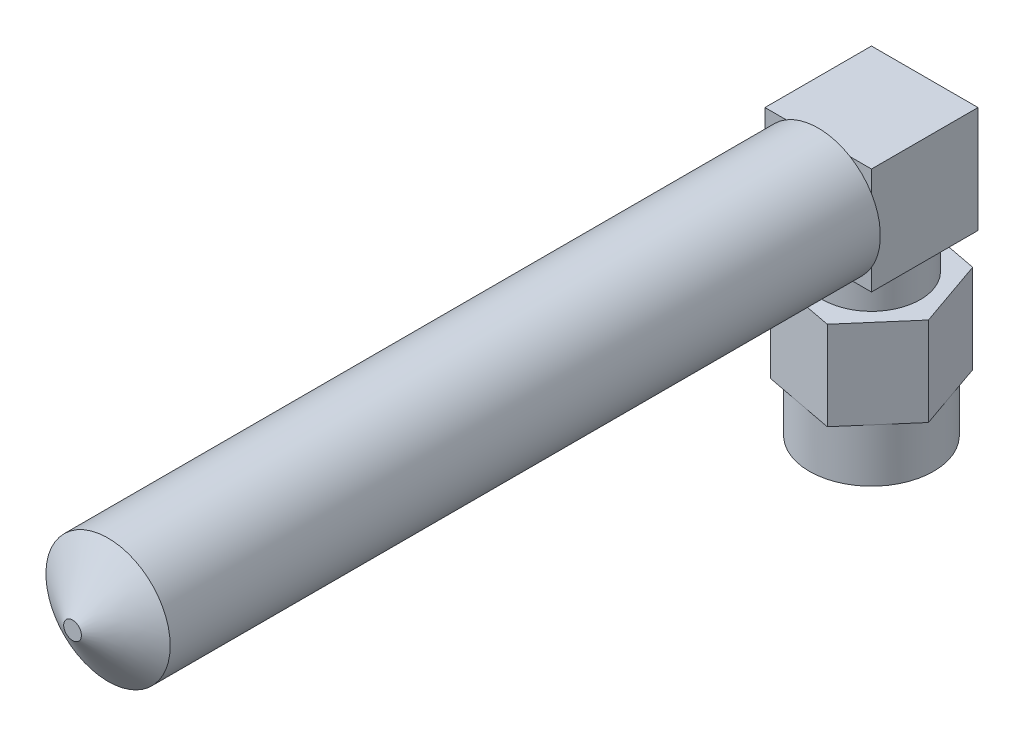
ISO-10303-21;
HEADER;
FILE_DESCRIPTION(('STEP AP214'),'2;1');
FILE_NAME('part.step','',(''),(''),'','','');
FILE_SCHEMA(('AUTOMOTIVE_DESIGN { 1 0 10303 214 1 1 1 1 }'));
ENDSEC;
DATA;
#1=APPLICATION_CONTEXT('core data for automotive mechanical design processes');
#2=APPLICATION_PROTOCOL_DEFINITION('international standard','automotive_design',2000,#1);
#3=PRODUCT_CONTEXT('',#1,'mechanical');
#4=PRODUCT('Part','Part','',(#3));
#5=PRODUCT_RELATED_PRODUCT_CATEGORY('part','',(#4));
#6=PRODUCT_DEFINITION_FORMATION('','',#4);
#7=PRODUCT_DEFINITION_CONTEXT('part definition',#1,'design');
#8=PRODUCT_DEFINITION('design','',#6,#7);
#9=PRODUCT_DEFINITION_SHAPE('','',#8);
#10=(LENGTH_UNIT() NAMED_UNIT(*) SI_UNIT(.MILLI.,.METRE.));
#11=(NAMED_UNIT(*) PLANE_ANGLE_UNIT() SI_UNIT($,.RADIAN.));
#12=(NAMED_UNIT(*) SI_UNIT($,.STERADIAN.) SOLID_ANGLE_UNIT());
#13=UNCERTAINTY_MEASURE_WITH_UNIT(LENGTH_MEASURE(1.E-05),#10,'distance_accuracy_value','');
#14=(GEOMETRIC_REPRESENTATION_CONTEXT(3) GLOBAL_UNCERTAINTY_ASSIGNED_CONTEXT((#13)) GLOBAL_UNIT_ASSIGNED_CONTEXT((#10,
#11,#12)) REPRESENTATION_CONTEXT('',''));
#15=CARTESIAN_POINT('',(0.,0.,0.));
#16=DIRECTION('',(0.,0.,1.));
#17=DIRECTION('',(1.,0.,0.));
#18=AXIS2_PLACEMENT_3D('',#15,#16,#17);
#19=CARTESIAN_POINT('',(3.,16.,3.));
#20=DIRECTION('',(0.,0.,-1.));
#21=DIRECTION('',(-1.,0.,0.));
#22=AXIS2_PLACEMENT_3D('',#19,#20,#21);
#23=PLANE('',#22);
#24=CARTESIAN_POINT('',(0.,13.,3.));
#25=DIRECTION('',(0.,0.,1.));
#26=DIRECTION('',(1.,0.,0.));
#27=AXIS2_PLACEMENT_3D('',#24,#25,#26);
#28=CIRCLE('',#27,3.5);
#29=CARTESIAN_POINT('',(3.,14.802775637732,3.));
#30=VERTEX_POINT('',#29);
#31=CARTESIAN_POINT('',(1.802775637732,16.,3.));
#32=VERTEX_POINT('',#31);
#33=EDGE_CURVE('E185',#30,#32,#28,.T.);
#34=ORIENTED_EDGE('',*,*,#33,.F.);
#35=DIRECTION('',(0.,-1.,0.));
#36=VECTOR('',#35,1.);
#37=CARTESIAN_POINT('',(3.,16.,3.));
#38=LINE('',#37,#36);
#39=CARTESIAN_POINT('',(3.,16.,3.));
#40=VERTEX_POINT('',#39);
#41=EDGE_CURVE('E166',#40,#30,#38,.T.);
#42=ORIENTED_EDGE('',*,*,#41,.F.);
#43=DIRECTION('',(1.,0.,0.));
#44=VECTOR('',#43,1.);
#45=CARTESIAN_POINT('',(3.,16.,3.));
#46=LINE('',#45,#44);
#47=EDGE_CURVE('E616',#32,#40,#46,.T.);
#48=ORIENTED_EDGE('',*,*,#47,.F.);
#49=EDGE_LOOP('',(#34,#42,#48));
#50=FACE_BOUND('',#49,.T.);
#51=ADVANCED_FACE('F36',(#50),#23,.F.);
#52=CARTESIAN_POINT('',(-1.802775637732,16.,3.));
#53=VERTEX_POINT('',#52);
#54=CARTESIAN_POINT('',(-3.,14.802775637732,3.));
#55=VERTEX_POINT('',#54);
#56=EDGE_CURVE('E11',#53,#55,#28,.T.);
#57=ORIENTED_EDGE('',*,*,#56,.F.);
#58=CARTESIAN_POINT('',(-3.,16.,3.));
#59=VERTEX_POINT('',#58);
#60=EDGE_CURVE('E615',#59,#53,#46,.T.);
#61=ORIENTED_EDGE('',*,*,#60,.F.);
#62=DIRECTION('',(0.,-1.,0.));
#63=VECTOR('',#62,1.);
#64=CARTESIAN_POINT('',(-3.,16.,3.));
#65=LINE('',#64,#63);
#66=EDGE_CURVE('E205',#59,#55,#65,.T.);
#67=ORIENTED_EDGE('',*,*,#66,.T.);
#68=EDGE_LOOP('',(#57,#61,#67));
#69=FACE_BOUND('',#68,.T.);
#70=ADVANCED_FACE('F309',(#69),#23,.F.);
#71=CARTESIAN_POINT('',(-3.,11.197224362268,3.));
#72=VERTEX_POINT('',#71);
#73=CARTESIAN_POINT('',(-1.80277563773199,10.,3.));
#74=VERTEX_POINT('',#73);
#75=EDGE_CURVE('E45',#72,#74,#28,.T.);
#76=ORIENTED_EDGE('',*,*,#75,.F.);
#77=CARTESIAN_POINT('',(-3.,10.,3.));
#78=VERTEX_POINT('',#77);
#79=EDGE_CURVE('E206',#72,#78,#65,.T.);
#80=ORIENTED_EDGE('',*,*,#79,.T.);
#81=DIRECTION('',(1.,0.,0.));
#82=VECTOR('',#81,1.);
#83=CARTESIAN_POINT('',(3.,10.,3.));
#84=LINE('',#83,#82);
#85=EDGE_CURVE('E627',#78,#74,#84,.T.);
#86=ORIENTED_EDGE('',*,*,#85,.T.);
#87=EDGE_LOOP('',(#76,#80,#86));
#88=FACE_BOUND('',#87,.T.);
#89=ADVANCED_FACE('F304',(#88),#23,.F.);
#90=CARTESIAN_POINT('',(0.,3.,0.));
#91=DIRECTION('',(0.,-1.,0.));
#92=DIRECTION('',(0.,0.,-1.));
#93=AXIS2_PLACEMENT_3D('',#90,#91,#92);
#94=CYLINDRICAL_SURFACE('',#93,3.5);
#95=CARTESIAN_POINT('',(0.,3.,0.));
#96=DIRECTION('',(0.,1.,0.));
#97=DIRECTION('',(0.,0.,1.));
#98=AXIS2_PLACEMENT_3D('',#95,#96,#97);
#99=CIRCLE('',#98,3.5);
#100=CARTESIAN_POINT('',(2.64807249743795,3.,2.28860482572084));
#101=VERTEX_POINT('',#100);
#102=CARTESIAN_POINT('',(3.30602616701688,3.,-1.14899564098375));
#103=VERTEX_POINT('',#102);
#104=EDGE_CURVE('E191',#101,#103,#99,.T.);
#105=ORIENTED_EDGE('',*,*,#104,.F.);
#106=CARTESIAN_POINT('',(-0.657953669578931,3.,3.43760046670459));
#107=VERTEX_POINT('',#106);
#108=EDGE_CURVE('E275',#107,#101,#99,.T.);
#109=ORIENTED_EDGE('',*,*,#108,.F.);
#110=CARTESIAN_POINT('',(-3.30602616701688,3.,1.14899564098375));
#111=VERTEX_POINT('',#110);
#112=EDGE_CURVE('E283',#111,#107,#99,.T.);
#113=ORIENTED_EDGE('',*,*,#112,.F.);
#114=CARTESIAN_POINT('',(-2.64807249743795,3.,-2.28860482572084));
#115=VERTEX_POINT('',#114);
#116=EDGE_CURVE('E288',#115,#111,#99,.T.);
#117=ORIENTED_EDGE('',*,*,#116,.F.);
#118=CARTESIAN_POINT('',(0.657953669578931,3.,-3.43760046670459));
#119=VERTEX_POINT('',#118);
#120=EDGE_CURVE('E281',#119,#115,#99,.T.);
#121=ORIENTED_EDGE('',*,*,#120,.F.);
#122=EDGE_CURVE('E274',#103,#119,#99,.T.);
#123=ORIENTED_EDGE('',*,*,#122,.F.);
#124=EDGE_LOOP('',(#105,#109,#113,#117,#121,#123));
#125=FACE_BOUND('',#124,.T.);
#126=CARTESIAN_POINT('',(0.,0.,0.));
#127=DIRECTION('',(0.,1.,0.));
#128=DIRECTION('',(0.,0.,1.));
#129=AXIS2_PLACEMENT_3D('',#126,#127,#128);
#130=CIRCLE('',#129,3.5);
#131=CARTESIAN_POINT('',(0.,0.,3.5));
#132=VERTEX_POINT('',#131);
#133=EDGE_CURVE('E40',#132,#132,#130,.T.);
#134=ORIENTED_EDGE('',*,*,#133,.T.);
#135=EDGE_LOOP('',(#134));
#136=FACE_BOUND('',#135,.T.);
#137=ADVANCED_FACE('F38',(#125,#136),#94,.T.);
#138=CARTESIAN_POINT('',(0.,0.,0.));
#139=DIRECTION('',(0.,1.,0.));
#140=DIRECTION('',(0.,0.,1.));
#141=AXIS2_PLACEMENT_3D('',#138,#139,#140);
#142=PLANE('',#141);
#143=CARTESIAN_POINT('',(0.,0.,0.));
#144=DIRECTION('',(0.,-1.,0.));
#145=DIRECTION('',(0.,0.,-1.));
#146=AXIS2_PLACEMENT_3D('',#143,#144,#145);
#147=CIRCLE('',#146,2.5);
#148=CARTESIAN_POINT('',(0.,0.,-2.5));
#149=VERTEX_POINT('',#148);
#150=EDGE_CURVE('E208',#149,#149,#147,.T.);
#151=ORIENTED_EDGE('',*,*,#150,.F.);
#152=EDGE_LOOP('',(#151));
#153=FACE_BOUND('',#152,.T.);
#154=ORIENTED_EDGE('',*,*,#133,.F.);
#155=EDGE_LOOP('',(#154));
#156=FACE_BOUND('',#155,.T.);
#157=ADVANCED_FACE('F293',(#153,#156),#142,.F.);
#158=CARTESIAN_POINT('',(0.,3.,0.));
#159=DIRECTION('',(0.,1.,0.));
#160=DIRECTION('',(0.,0.,1.));
#161=AXIS2_PLACEMENT_3D('',#158,#159,#160);
#162=PLANE('',#161);
#163=DIRECTION('',(0.653887093063098,0.,-0.75659214212513));
#164=VECTOR('',#163,1.);
#165=CARTESIAN_POINT('',(1.32674588523935,3.,3.81747019495029));
#166=LINE('',#165,#164);
#167=CARTESIAN_POINT('',(3.96939910963656,3.,0.759739456491395));
#168=VERTEX_POINT('',#167);
#169=EDGE_CURVE('E254',#101,#168,#166,.T.);
#170=ORIENTED_EDGE('',*,*,#169,.F.);
#171=ORIENTED_EDGE('',*,*,#104,.T.);
#172=DIRECTION('',(-0.3282844688525,0.,-0.944578904861966));
#173=VECTOR('',#172,1.);
#174=CARTESIAN_POINT('',(3.96939910963656,3.,0.759739456491395));
#175=LINE('',#174,#173);
#176=EDGE_CURVE('E235',#168,#103,#175,.T.);
#177=ORIENTED_EDGE('',*,*,#176,.F.);
#178=EDGE_LOOP('',(#170,#171,#177));
#179=FACE_BOUND('',#178,.T.);
#180=ADVANCED_FACE('F295',(#179),#162,.F.);
#181=CARTESIAN_POINT('',(2.64265322439721,3.,-3.05773073845889));
#182=VERTEX_POINT('',#181);
#183=EDGE_CURVE('E218',#103,#182,#175,.T.);
#184=ORIENTED_EDGE('',*,*,#183,.F.);
#185=ORIENTED_EDGE('',*,*,#122,.T.);
#186=DIRECTION('',(-0.982171561915597,0.,-0.187986762736838));
#187=VECTOR('',#186,1.);
#188=CARTESIAN_POINT('',(2.64265322439721,3.,-3.05773073845889));
#189=LINE('',#188,#187);
#190=EDGE_CURVE('E239',#182,#119,#189,.T.);
#191=ORIENTED_EDGE('',*,*,#190,.F.);
#192=EDGE_LOOP('',(#184,#185,#191));
#193=FACE_BOUND('',#192,.T.);
#194=ADVANCED_FACE('F301',(#193),#162,.F.);
#195=CARTESIAN_POINT('',(-1.32674588523935,3.,-3.81747019495029));
#196=VERTEX_POINT('',#195);
#197=EDGE_CURVE('E238',#119,#196,#189,.T.);
#198=ORIENTED_EDGE('',*,*,#197,.F.);
#199=ORIENTED_EDGE('',*,*,#120,.T.);
#200=DIRECTION('',(-0.653887093063097,0.,0.75659214212513));
#201=VECTOR('',#200,1.);
#202=CARTESIAN_POINT('',(-1.32674588523935,3.,-3.81747019495029));
#203=LINE('',#202,#201);
#204=EDGE_CURVE('E243',#196,#115,#203,.T.);
#205=ORIENTED_EDGE('',*,*,#204,.F.);
#206=EDGE_LOOP('',(#198,#199,#205));
#207=FACE_BOUND('',#206,.T.);
#208=ADVANCED_FACE('F352',(#207),#162,.F.);
#209=CARTESIAN_POINT('',(-3.96939910963656,3.,-0.759739456491394));
#210=VERTEX_POINT('',#209);
#211=EDGE_CURVE('E242',#115,#210,#203,.T.);
#212=ORIENTED_EDGE('',*,*,#211,.F.);
#213=ORIENTED_EDGE('',*,*,#116,.T.);
#214=DIRECTION('',(0.3282844688525,0.,0.944578904861966));
#215=VECTOR('',#214,1.);
#216=CARTESIAN_POINT('',(-3.96939910963656,3.,-0.759739456491394));
#217=LINE('',#216,#215);
#218=EDGE_CURVE('E247',#210,#111,#217,.T.);
#219=ORIENTED_EDGE('',*,*,#218,.F.);
#220=EDGE_LOOP('',(#212,#213,#219));
#221=FACE_BOUND('',#220,.T.);
#222=ADVANCED_FACE('F361',(#221),#162,.F.);
#223=CARTESIAN_POINT('',(-2.64265322439721,3.,3.05773073845889));
#224=VERTEX_POINT('',#223);
#225=EDGE_CURVE('E246',#111,#224,#217,.T.);
#226=ORIENTED_EDGE('',*,*,#225,.F.);
#227=ORIENTED_EDGE('',*,*,#112,.T.);
#228=DIRECTION('',(0.982171561915597,0.,0.187986762736837));
#229=VECTOR('',#228,1.);
#230=CARTESIAN_POINT('',(-2.64265322439721,3.,3.05773073845889));
#231=LINE('',#230,#229);
#232=EDGE_CURVE('E251',#224,#107,#231,.T.);
#233=ORIENTED_EDGE('',*,*,#232,.F.);
#234=EDGE_LOOP('',(#226,#227,#233));
#235=FACE_BOUND('',#234,.T.);
#236=ADVANCED_FACE('F370',(#235),#162,.F.);
#237=CARTESIAN_POINT('',(1.32674588523935,3.,3.81747019495029));
#238=VERTEX_POINT('',#237);
#239=EDGE_CURVE('E250',#107,#238,#231,.T.);
#240=ORIENTED_EDGE('',*,*,#239,.F.);
#241=ORIENTED_EDGE('',*,*,#108,.T.);
#242=EDGE_CURVE('E224',#238,#101,#166,.T.);
#243=ORIENTED_EDGE('',*,*,#242,.F.);
#244=EDGE_LOOP('',(#240,#241,#243));
#245=FACE_BOUND('',#244,.T.);
#246=ADVANCED_FACE('F303',(#245),#162,.F.);
#247=CARTESIAN_POINT('',(3.96939910963656,8.,0.759739456491395));
#248=DIRECTION('',(-0.944578904861966,0.,0.3282844688525));
#249=DIRECTION('',(0.3282844688525,0.,0.944578904861967));
#250=AXIS2_PLACEMENT_3D('',#247,#248,#249);
#251=PLANE('',#250);
#252=ORIENTED_EDGE('',*,*,#176,.T.);
#253=ORIENTED_EDGE('',*,*,#183,.T.);
#254=DIRECTION('',(0.,-1.,0.));
#255=VECTOR('',#254,1.);
#256=CARTESIAN_POINT('',(2.64265322439721,8.,-3.05773073845889));
#257=LINE('',#256,#255);
#258=CARTESIAN_POINT('',(2.64265322439721,8.,-3.05773073845889));
#259=VERTEX_POINT('',#258);
#260=EDGE_CURVE('E271',#259,#182,#257,.T.);
#261=ORIENTED_EDGE('',*,*,#260,.F.);
#262=DIRECTION('',(-0.3282844688525,0.,-0.944578904861966));
#263=VECTOR('',#262,1.);
#264=CARTESIAN_POINT('',(3.96939910963656,8.,0.759739456491395));
#265=LINE('',#264,#263);
#266=CARTESIAN_POINT('',(3.96939910963656,8.,0.759739456491395));
#267=VERTEX_POINT('',#266);
#268=EDGE_CURVE('E220',#267,#259,#265,.T.);
#269=ORIENTED_EDGE('',*,*,#268,.F.);
#270=DIRECTION('',(0.,-1.,0.));
#271=VECTOR('',#270,1.);
#272=CARTESIAN_POINT('',(3.96939910963656,8.,0.759739456491395));
#273=LINE('',#272,#271);
#274=EDGE_CURVE('E234',#267,#168,#273,.T.);
#275=ORIENTED_EDGE('',*,*,#274,.T.);
#276=EDGE_LOOP('',(#252,#253,#261,#269,#275));
#277=FACE_BOUND('',#276,.T.);
#278=ADVANCED_FACE('F387',(#277),#251,.F.);
#279=CARTESIAN_POINT('',(2.64265322439721,8.,-3.05773073845889));
#280=DIRECTION('',(-0.187986762736837,0.,0.982171561915597));
#281=DIRECTION('',(0.982171561915597,0.,0.187986762736837));
#282=AXIS2_PLACEMENT_3D('',#279,#280,#281);
#283=PLANE('',#282);
#284=ORIENTED_EDGE('',*,*,#190,.T.);
#285=ORIENTED_EDGE('',*,*,#197,.T.);
#286=DIRECTION('',(0.,-1.,0.));
#287=VECTOR('',#286,1.);
#288=CARTESIAN_POINT('',(-1.32674588523935,8.,-3.81747019495029));
#289=LINE('',#288,#287);
#290=CARTESIAN_POINT('',(-1.32674588523935,8.,-3.81747019495029));
#291=VERTEX_POINT('',#290);
#292=EDGE_CURVE('E268',#291,#196,#289,.T.);
#293=ORIENTED_EDGE('',*,*,#292,.F.);
#294=DIRECTION('',(-0.982171561915597,0.,-0.187986762736838));
#295=VECTOR('',#294,1.);
#296=CARTESIAN_POINT('',(2.64265322439721,8.,-3.05773073845889));
#297=LINE('',#296,#295);
#298=EDGE_CURVE('E223',#259,#291,#297,.T.);
#299=ORIENTED_EDGE('',*,*,#298,.F.);
#300=ORIENTED_EDGE('',*,*,#260,.T.);
#301=EDGE_LOOP('',(#284,#285,#293,#299,#300));
#302=FACE_BOUND('',#301,.T.);
#303=ADVANCED_FACE('F395',(#302),#283,.F.);
#304=CARTESIAN_POINT('',(-1.32674588523935,8.,-3.81747019495029));
#305=DIRECTION('',(0.75659214212513,0.,0.653887093063097));
#306=DIRECTION('',(0.653887093063097,0.,-0.75659214212513));
#307=AXIS2_PLACEMENT_3D('',#304,#305,#306);
#308=PLANE('',#307);
#309=ORIENTED_EDGE('',*,*,#204,.T.);
#310=ORIENTED_EDGE('',*,*,#211,.T.);
#311=DIRECTION('',(0.,-1.,0.));
#312=VECTOR('',#311,1.);
#313=CARTESIAN_POINT('',(-3.96939910963656,8.,-0.759739456491394));
#314=LINE('',#313,#312);
#315=CARTESIAN_POINT('',(-3.96939910963656,8.,-0.759739456491394));
#316=VERTEX_POINT('',#315);
#317=EDGE_CURVE('E265',#316,#210,#314,.T.);
#318=ORIENTED_EDGE('',*,*,#317,.F.);
#319=DIRECTION('',(-0.653887093063097,0.,0.75659214212513));
#320=VECTOR('',#319,1.);
#321=CARTESIAN_POINT('',(-1.32674588523935,8.,-3.81747019495029));
#322=LINE('',#321,#320);
#323=EDGE_CURVE('E226',#291,#316,#322,.T.);
#324=ORIENTED_EDGE('',*,*,#323,.F.);
#325=ORIENTED_EDGE('',*,*,#292,.T.);
#326=EDGE_LOOP('',(#309,#310,#318,#324,#325));
#327=FACE_BOUND('',#326,.T.);
#328=ADVANCED_FACE('F404',(#327),#308,.F.);
#329=CARTESIAN_POINT('',(-3.96939910963656,8.,-0.759739456491394));
#330=DIRECTION('',(0.944578904861966,0.,-0.3282844688525));
#331=DIRECTION('',(-0.3282844688525,0.,-0.944578904861966));
#332=AXIS2_PLACEMENT_3D('',#329,#330,#331);
#333=PLANE('',#332);
#334=ORIENTED_EDGE('',*,*,#218,.T.);
#335=ORIENTED_EDGE('',*,*,#225,.T.);
#336=DIRECTION('',(0.,-1.,0.));
#337=VECTOR('',#336,1.);
#338=CARTESIAN_POINT('',(-2.64265322439721,8.,3.05773073845889));
#339=LINE('',#338,#337);
#340=CARTESIAN_POINT('',(-2.64265322439721,8.,3.05773073845889));
#341=VERTEX_POINT('',#340);
#342=EDGE_CURVE('E262',#341,#224,#339,.T.);
#343=ORIENTED_EDGE('',*,*,#342,.F.);
#344=DIRECTION('',(0.3282844688525,0.,0.944578904861966));
#345=VECTOR('',#344,1.);
#346=CARTESIAN_POINT('',(-3.96939910963656,8.,-0.759739456491394));
#347=LINE('',#346,#345);
#348=EDGE_CURVE('E228',#316,#341,#347,.T.);
#349=ORIENTED_EDGE('',*,*,#348,.F.);
#350=ORIENTED_EDGE('',*,*,#317,.T.);
#351=EDGE_LOOP('',(#334,#335,#343,#349,#350));
#352=FACE_BOUND('',#351,.T.);
#353=ADVANCED_FACE('F414',(#352),#333,.F.);
#354=CARTESIAN_POINT('',(-2.64265322439721,8.,3.05773073845889));
#355=DIRECTION('',(0.187986762736837,0.,-0.982171561915598));
#356=DIRECTION('',(-0.982171561915597,0.,-0.187986762736837));
#357=AXIS2_PLACEMENT_3D('',#354,#355,#356);
#358=PLANE('',#357);
#359=ORIENTED_EDGE('',*,*,#232,.T.);
#360=ORIENTED_EDGE('',*,*,#239,.T.);
#361=DIRECTION('',(0.,-1.,0.));
#362=VECTOR('',#361,1.);
#363=CARTESIAN_POINT('',(1.32674588523935,8.,3.81747019495029));
#364=LINE('',#363,#362);
#365=CARTESIAN_POINT('',(1.32674588523935,8.,3.81747019495029));
#366=VERTEX_POINT('',#365);
#367=EDGE_CURVE('E259',#366,#238,#364,.T.);
#368=ORIENTED_EDGE('',*,*,#367,.F.);
#369=DIRECTION('',(0.982171561915597,0.,0.187986762736837));
#370=VECTOR('',#369,1.);
#371=CARTESIAN_POINT('',(-2.64265322439721,8.,3.05773073845889));
#372=LINE('',#371,#370);
#373=EDGE_CURVE('E230',#341,#366,#372,.T.);
#374=ORIENTED_EDGE('',*,*,#373,.F.);
#375=ORIENTED_EDGE('',*,*,#342,.T.);
#376=EDGE_LOOP('',(#359,#360,#368,#374,#375));
#377=FACE_BOUND('',#376,.T.);
#378=ADVANCED_FACE('F424',(#377),#358,.F.);
#379=CARTESIAN_POINT('',(1.32674588523935,8.,3.81747019495029));
#380=DIRECTION('',(-0.75659214212513,0.,-0.653887093063098));
#381=DIRECTION('',(-0.653887093063098,0.,0.75659214212513));
#382=AXIS2_PLACEMENT_3D('',#379,#380,#381);
#383=PLANE('',#382);
#384=ORIENTED_EDGE('',*,*,#242,.T.);
#385=ORIENTED_EDGE('',*,*,#169,.T.);
#386=ORIENTED_EDGE('',*,*,#274,.F.);
#387=DIRECTION('',(0.653887093063098,0.,-0.75659214212513));
#388=VECTOR('',#387,1.);
#389=CARTESIAN_POINT('',(1.32674588523935,8.,3.81747019495029));
#390=LINE('',#389,#388);
#391=EDGE_CURVE('E232',#366,#267,#390,.T.);
#392=ORIENTED_EDGE('',*,*,#391,.F.);
#393=ORIENTED_EDGE('',*,*,#367,.T.);
#394=EDGE_LOOP('',(#384,#385,#386,#392,#393));
#395=FACE_BOUND('',#394,.T.);
#396=ADVANCED_FACE('F434',(#395),#383,.F.);
#397=CARTESIAN_POINT('',(0.,8.,0.));
#398=DIRECTION('',(0.,1.,0.));
#399=DIRECTION('',(0.,0.,1.));
#400=AXIS2_PLACEMENT_3D('',#397,#398,#399);
#401=PLANE('',#400);
#402=CARTESIAN_POINT('',(0.,8.,0.));
#403=DIRECTION('',(0.,1.,0.));
#404=DIRECTION('',(0.,0.,1.));
#405=AXIS2_PLACEMENT_3D('',#402,#403,#404);
#406=CIRCLE('',#405,2.75);
#407=CARTESIAN_POINT('',(0.,8.,2.75));
#408=VERTEX_POINT('',#407);
#409=EDGE_CURVE('E189',#408,#408,#406,.T.);
#410=ORIENTED_EDGE('',*,*,#409,.F.);
#411=EDGE_LOOP('',(#410));
#412=FACE_BOUND('',#411,.T.);
#413=ORIENTED_EDGE('',*,*,#268,.T.);
#414=ORIENTED_EDGE('',*,*,#298,.T.);
#415=ORIENTED_EDGE('',*,*,#323,.T.);
#416=ORIENTED_EDGE('',*,*,#348,.T.);
#417=ORIENTED_EDGE('',*,*,#373,.T.);
#418=ORIENTED_EDGE('',*,*,#391,.T.);
#419=EDGE_LOOP('',(#413,#414,#415,#416,#417,#418));
#420=FACE_BOUND('',#419,.T.);
#421=ADVANCED_FACE('F444',(#412,#420),#401,.T.);
#422=CARTESIAN_POINT('',(0.,10.,0.));
#423=DIRECTION('',(0.,-1.,0.));
#424=DIRECTION('',(0.,0.,-1.));
#425=AXIS2_PLACEMENT_3D('',#422,#423,#424);
#426=CYLINDRICAL_SURFACE('',#425,2.75);
#427=CARTESIAN_POINT('',(0.,10.,0.));
#428=DIRECTION('',(0.,1.,0.));
#429=DIRECTION('',(0.,0.,1.));
#430=AXIS2_PLACEMENT_3D('',#427,#428,#429);
#431=CIRCLE('',#430,2.75);
#432=CARTESIAN_POINT('',(0.,10.,2.75));
#433=VERTEX_POINT('',#432);
#434=EDGE_CURVE('E214',#433,#433,#431,.T.);
#435=ORIENTED_EDGE('',*,*,#434,.F.);
#436=EDGE_LOOP('',(#435));
#437=FACE_BOUND('',#436,.T.);
#438=ORIENTED_EDGE('',*,*,#409,.T.);
#439=EDGE_LOOP('',(#438));
#440=FACE_BOUND('',#439,.T.);
#441=ADVANCED_FACE('F454',(#437,#440),#426,.T.);
#442=CARTESIAN_POINT('',(0.,5.,0.));
#443=DIRECTION('',(0.,-1.,0.));
#444=DIRECTION('',(0.,0.,-1.));
#445=AXIS2_PLACEMENT_3D('',#442,#443,#444);
#446=CYLINDRICAL_SURFACE('',#445,2.5);
#447=CARTESIAN_POINT('',(0.,5.,0.));
#448=DIRECTION('',(0.,-1.,0.));
#449=DIRECTION('',(0.,0.,-1.));
#450=AXIS2_PLACEMENT_3D('',#447,#448,#449);
#451=CIRCLE('',#450,2.5);
#452=CARTESIAN_POINT('',(0.,5.,-2.5));
#453=VERTEX_POINT('',#452);
#454=EDGE_CURVE('E211',#453,#453,#451,.T.);
#455=ORIENTED_EDGE('',*,*,#454,.F.);
#456=EDGE_LOOP('',(#455));
#457=FACE_BOUND('',#456,.T.);
#458=ORIENTED_EDGE('',*,*,#150,.T.);
#459=EDGE_LOOP('',(#458));
#460=FACE_BOUND('',#459,.T.);
#461=ADVANCED_FACE('F463',(#457,#460),#446,.F.);
#462=CARTESIAN_POINT('',(0.,5.,0.));
#463=DIRECTION('',(0.,-1.,0.));
#464=DIRECTION('',(0.,0.,-1.));
#465=AXIS2_PLACEMENT_3D('',#462,#463,#464);
#466=PLANE('',#465);
#467=ORIENTED_EDGE('',*,*,#454,.T.);
#468=EDGE_LOOP('',(#467));
#469=FACE_BOUND('',#468,.T.);
#470=ADVANCED_FACE('F325',(#469),#466,.T.);
#471=CARTESIAN_POINT('',(-3.,16.,3.));
#472=DIRECTION('',(1.,0.,0.));
#473=DIRECTION('',(0.,0.,-1.));
#474=AXIS2_PLACEMENT_3D('',#471,#472,#473);
#475=PLANE('',#474);
#476=DIRECTION('',(0.,0.,1.));
#477=VECTOR('',#476,1.);
#478=CARTESIAN_POINT('',(-3.,10.,3.));
#479=LINE('',#478,#477);
#480=CARTESIAN_POINT('',(-3.,10.,-3.));
#481=VERTEX_POINT('',#480);
#482=EDGE_CURVE('E198',#481,#78,#479,.T.);
#483=ORIENTED_EDGE('',*,*,#482,.T.);
#484=ORIENTED_EDGE('',*,*,#79,.F.);
#485=EDGE_CURVE('E60',#55,#72,#65,.T.);
#486=ORIENTED_EDGE('',*,*,#485,.F.);
#487=ORIENTED_EDGE('',*,*,#66,.F.);
#488=DIRECTION('',(0.,0.,1.));
#489=VECTOR('',#488,1.);
#490=CARTESIAN_POINT('',(-3.,16.,3.));
#491=LINE('',#490,#489);
#492=CARTESIAN_POINT('',(-3.,16.,-3.));
#493=VERTEX_POINT('',#492);
#494=EDGE_CURVE('E619',#493,#59,#491,.T.);
#495=ORIENTED_EDGE('',*,*,#494,.F.);
#496=DIRECTION('',(0.,-1.,0.));
#497=VECTOR('',#496,1.);
#498=CARTESIAN_POINT('',(-3.,16.,-3.));
#499=LINE('',#498,#497);
#500=EDGE_CURVE('E624',#493,#481,#499,.T.);
#501=ORIENTED_EDGE('',*,*,#500,.T.);
#502=EDGE_LOOP('',(#483,#484,#486,#487,#495,#501));
#503=FACE_BOUND('',#502,.T.);
#504=ADVANCED_FACE('F319',(#503),#475,.F.);
#505=CARTESIAN_POINT('',(1.80277563773199,10.,3.));
#506=VERTEX_POINT('',#505);
#507=CARTESIAN_POINT('',(3.,11.197224362268,3.));
#508=VERTEX_POINT('',#507);
#509=EDGE_CURVE('E174',#506,#508,#28,.T.);
#510=ORIENTED_EDGE('',*,*,#509,.F.);
#511=CARTESIAN_POINT('',(3.,10.,3.));
#512=VERTEX_POINT('',#511);
#513=EDGE_CURVE('E176',#506,#512,#84,.T.);
#514=ORIENTED_EDGE('',*,*,#513,.T.);
#515=EDGE_CURVE('E162',#508,#512,#38,.T.);
#516=ORIENTED_EDGE('',*,*,#515,.F.);
#517=EDGE_LOOP('',(#510,#514,#516));
#518=FACE_BOUND('',#517,.T.);
#519=ADVANCED_FACE('F172',(#518),#23,.F.);
#520=CARTESIAN_POINT('',(3.,16.,3.));
#521=DIRECTION('',(-1.,0.,0.));
#522=DIRECTION('',(0.,0.,1.));
#523=AXIS2_PLACEMENT_3D('',#520,#521,#522);
#524=PLANE('',#523);
#525=DIRECTION('',(0.,0.,-1.));
#526=VECTOR('',#525,1.);
#527=CARTESIAN_POINT('',(3.,10.,3.));
#528=LINE('',#527,#526);
#529=CARTESIAN_POINT('',(3.,10.,-3.));
#530=VERTEX_POINT('',#529);
#531=EDGE_CURVE('E629',#512,#530,#528,.T.);
#532=ORIENTED_EDGE('',*,*,#531,.T.);
#533=DIRECTION('',(0.,-1.,0.));
#534=VECTOR('',#533,1.);
#535=CARTESIAN_POINT('',(3.,16.,-3.));
#536=LINE('',#535,#534);
#537=CARTESIAN_POINT('',(3.,16.,-3.));
#538=VERTEX_POINT('',#537);
#539=EDGE_CURVE('E178',#538,#530,#536,.T.);
#540=ORIENTED_EDGE('',*,*,#539,.F.);
#541=DIRECTION('',(0.,0.,-1.));
#542=VECTOR('',#541,1.);
#543=CARTESIAN_POINT('',(3.,16.,3.));
#544=LINE('',#543,#542);
#545=EDGE_CURVE('E618',#40,#538,#544,.T.);
#546=ORIENTED_EDGE('',*,*,#545,.F.);
#547=ORIENTED_EDGE('',*,*,#41,.T.);
#548=EDGE_CURVE('E159',#30,#508,#38,.T.);
#549=ORIENTED_EDGE('',*,*,#548,.T.);
#550=ORIENTED_EDGE('',*,*,#515,.T.);
#551=EDGE_LOOP('',(#532,#540,#546,#547,#549,#550));
#552=FACE_BOUND('',#551,.T.);
#553=ADVANCED_FACE('F161',(#552),#524,.F.);
#554=CARTESIAN_POINT('',(3.,16.,-3.));
#555=DIRECTION('',(0.,0.,1.));
#556=DIRECTION('',(1.,0.,0.));
#557=AXIS2_PLACEMENT_3D('',#554,#555,#556);
#558=PLANE('',#557);
#559=DIRECTION('',(-1.,0.,0.));
#560=VECTOR('',#559,1.);
#561=CARTESIAN_POINT('',(3.,10.,-3.));
#562=LINE('',#561,#560);
#563=EDGE_CURVE('E632',#530,#481,#562,.T.);
#564=ORIENTED_EDGE('',*,*,#563,.T.);
#565=ORIENTED_EDGE('',*,*,#500,.F.);
#566=DIRECTION('',(-1.,0.,0.));
#567=VECTOR('',#566,1.);
#568=CARTESIAN_POINT('',(3.,16.,-3.));
#569=LINE('',#568,#567);
#570=EDGE_CURVE('E622',#538,#493,#569,.T.);
#571=ORIENTED_EDGE('',*,*,#570,.F.);
#572=ORIENTED_EDGE('',*,*,#539,.T.);
#573=EDGE_LOOP('',(#564,#565,#571,#572));
#574=FACE_BOUND('',#573,.T.);
#575=ADVANCED_FACE('F324',(#574),#558,.F.);
#576=CARTESIAN_POINT('',(0.,16.,0.));
#577=DIRECTION('',(0.,1.,0.));
#578=DIRECTION('',(0.,0.,1.));
#579=AXIS2_PLACEMENT_3D('',#576,#577,#578);
#580=PLANE('',#579);
#581=ORIENTED_EDGE('',*,*,#494,.T.);
#582=ORIENTED_EDGE('',*,*,#60,.T.);
#583=EDGE_CURVE('E613',#53,#32,#46,.T.);
#584=ORIENTED_EDGE('',*,*,#583,.T.);
#585=ORIENTED_EDGE('',*,*,#47,.T.);
#586=ORIENTED_EDGE('',*,*,#545,.T.);
#587=ORIENTED_EDGE('',*,*,#570,.T.);
#588=EDGE_LOOP('',(#581,#582,#584,#585,#586,#587));
#589=FACE_BOUND('',#588,.T.);
#590=ADVANCED_FACE('F495',(#589),#580,.T.);
#591=CARTESIAN_POINT('',(0.,10.,0.));
#592=DIRECTION('',(0.,1.,0.));
#593=DIRECTION('',(0.,0.,1.));
#594=AXIS2_PLACEMENT_3D('',#591,#592,#593);
#595=PLANE('',#594);
#596=ORIENTED_EDGE('',*,*,#434,.T.);
#597=EDGE_LOOP('',(#596));
#598=FACE_BOUND('',#597,.T.);
#599=ORIENTED_EDGE('',*,*,#482,.F.);
#600=ORIENTED_EDGE('',*,*,#563,.F.);
#601=ORIENTED_EDGE('',*,*,#531,.F.);
#602=ORIENTED_EDGE('',*,*,#513,.F.);
#603=EDGE_CURVE('E630',#74,#506,#84,.T.);
#604=ORIENTED_EDGE('',*,*,#603,.F.);
#605=ORIENTED_EDGE('',*,*,#85,.F.);
#606=EDGE_LOOP('',(#599,#600,#601,#602,#604,#605));
#607=FACE_BOUND('',#606,.T.);
#608=ADVANCED_FACE('F516',(#598,#607),#595,.F.);
#609=CARTESIAN_POINT('',(0.,13.,3.));
#610=DIRECTION('',(0.,0.,1.));
#611=DIRECTION('',(1.,0.,0.));
#612=AXIS2_PLACEMENT_3D('',#609,#610,#611);
#613=PLANE('',#612);
#614=EDGE_CURVE('E183',#74,#506,#28,.T.);
#615=ORIENTED_EDGE('',*,*,#614,.F.);
#616=ORIENTED_EDGE('',*,*,#603,.T.);
#617=EDGE_LOOP('',(#615,#616));
#618=FACE_BOUND('',#617,.T.);
#619=ADVANCED_FACE('F521',(#618),#613,.F.);
#620=ORIENTED_EDGE('',*,*,#548,.F.);
#621=EDGE_CURVE('E179',#508,#30,#28,.T.);
#622=ORIENTED_EDGE('',*,*,#621,.F.);
#623=EDGE_LOOP('',(#620,#622));
#624=FACE_BOUND('',#623,.T.);
#625=ADVANCED_FACE('F180',(#624),#613,.F.);
#626=EDGE_CURVE('E199',#55,#72,#28,.T.);
#627=ORIENTED_EDGE('',*,*,#626,.F.);
#628=ORIENTED_EDGE('',*,*,#485,.T.);
#629=EDGE_LOOP('',(#627,#628));
#630=FACE_BOUND('',#629,.T.);
#631=ADVANCED_FACE('F204',(#630),#613,.F.);
#632=CARTESIAN_POINT('',(0.,13.,43.));
#633=DIRECTION('',(0.,0.,-1.));
#634=DIRECTION('',(-1.,0.,0.));
#635=AXIS2_PLACEMENT_3D('',#632,#633,#634);
#636=CYLINDRICAL_SURFACE('',#635,3.5);
#637=CARTESIAN_POINT('',(0.,13.,43.));
#638=DIRECTION('',(0.,0.,1.));
#639=DIRECTION('',(1.,0.,0.));
#640=AXIS2_PLACEMENT_3D('',#637,#638,#639);
#641=CIRCLE('',#640,3.5);
#642=CARTESIAN_POINT('',(3.5,13.,43.));
#643=VERTEX_POINT('',#642);
#644=EDGE_CURVE('E195',#643,#643,#641,.T.);
#645=ORIENTED_EDGE('',*,*,#644,.F.);
#646=EDGE_LOOP('',(#645));
#647=FACE_BOUND('',#646,.T.);
#648=ORIENTED_EDGE('',*,*,#33,.T.);
#649=EDGE_CURVE('E47',#32,#53,#28,.T.);
#650=ORIENTED_EDGE('',*,*,#649,.T.);
#651=ORIENTED_EDGE('',*,*,#56,.T.);
#652=ORIENTED_EDGE('',*,*,#626,.T.);
#653=ORIENTED_EDGE('',*,*,#75,.T.);
#654=ORIENTED_EDGE('',*,*,#614,.T.);
#655=ORIENTED_EDGE('',*,*,#509,.T.);
#656=ORIENTED_EDGE('',*,*,#621,.T.);
#657=EDGE_LOOP('',(#648,#650,#651,#652,#653,#654,#655,#656));
#658=FACE_BOUND('',#657,.T.);
#659=ADVANCED_FACE('F187',(#647,#658),#636,.T.);
#660=ORIENTED_EDGE('',*,*,#583,.F.);
#661=ORIENTED_EDGE('',*,*,#649,.F.);
#662=EDGE_LOOP('',(#660,#661));
#663=FACE_BOUND('',#662,.T.);
#664=ADVANCED_FACE('F552',(#663),#613,.F.);
#665=CARTESIAN_POINT('',(0.,13.,43.));
#666=DIRECTION('',(0.,0.,-1.));
#667=DIRECTION('',(-1.,0.,0.));
#668=AXIS2_PLACEMENT_3D('',#665,#666,#667);
#669=CONICAL_SURFACE('',#668,3.5,0.982793723247328);
#670=CARTESIAN_POINT('',(0.,13.,45.));
#671=DIRECTION('',(0.,0.,1.));
#672=DIRECTION('',(1.,0.,0.));
#673=AXIS2_PLACEMENT_3D('',#670,#671,#672);
#674=CIRCLE('',#673,0.5);
#675=CARTESIAN_POINT('',(0.5,13.,45.));
#676=VERTEX_POINT('',#675);
#677=EDGE_CURVE('E184',#676,#676,#674,.T.);
#678=ORIENTED_EDGE('',*,*,#677,.F.);
#679=EDGE_LOOP('',(#678));
#680=FACE_BOUND('',#679,.T.);
#681=ORIENTED_EDGE('',*,*,#644,.T.);
#682=EDGE_LOOP('',(#681));
#683=FACE_BOUND('',#682,.T.);
#684=ADVANCED_FACE('F574',(#680,#683),#669,.T.);
#685=CARTESIAN_POINT('',(0.,13.,45.));
#686=DIRECTION('',(0.,0.,-1.));
#687=DIRECTION('',(-1.,0.,0.));
#688=AXIS2_PLACEMENT_3D('',#685,#686,#687);
#689=PLANE('',#688);
#690=ORIENTED_EDGE('',*,*,#677,.T.);
#691=EDGE_LOOP('',(#690));
#692=FACE_BOUND('',#691,.T.);
#693=ADVANCED_FACE('F581',(#692),#689,.F.);
#694=CLOSED_SHELL('',(#51,#70,#89,#137,#157,#180,#194,#208,#222,#236,#246,#278,#303,#328,#353,
#378,#396,#421,#441,#461,#470,#504,#519,#553,#575,#590,#608,#619,#625,#631,#659,#664,#684,#693));
#695=MANIFOLD_SOLID_BREP('B2',#694);
#696=ADVANCED_BREP_SHAPE_REPRESENTATION('',(#18,#695),#14);
#697=SHAPE_DEFINITION_REPRESENTATION(#9,#696);
ENDSEC;
END-ISO-10303-21;
